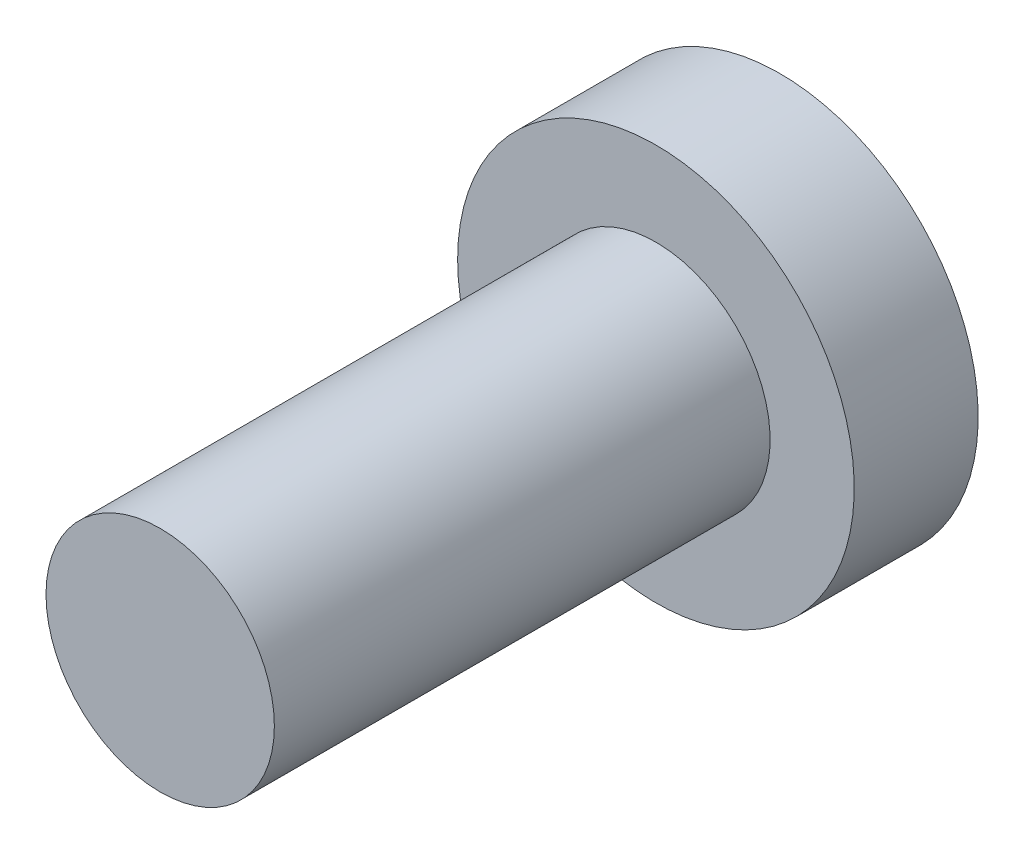
ISO-10303-21;
HEADER;
FILE_DESCRIPTION(('STEP AP214'),'2;1');
FILE_NAME('part.step','',(''),(''),'','','');
FILE_SCHEMA(('AUTOMOTIVE_DESIGN { 1 0 10303 214 1 1 1 1 }'));
ENDSEC;
DATA;
#1=APPLICATION_CONTEXT('core data for automotive mechanical design processes');
#2=APPLICATION_PROTOCOL_DEFINITION('international standard','automotive_design',2000,#1);
#3=PRODUCT_CONTEXT('',#1,'mechanical');
#4=PRODUCT('Part','Part','',(#3));
#5=PRODUCT_RELATED_PRODUCT_CATEGORY('part','',(#4));
#6=PRODUCT_DEFINITION_FORMATION('','',#4);
#7=PRODUCT_DEFINITION_CONTEXT('part definition',#1,'design');
#8=PRODUCT_DEFINITION('design','',#6,#7);
#9=PRODUCT_DEFINITION_SHAPE('','',#8);
#10=(LENGTH_UNIT() NAMED_UNIT(*) SI_UNIT(.MILLI.,.METRE.));
#11=(NAMED_UNIT(*) PLANE_ANGLE_UNIT() SI_UNIT($,.RADIAN.));
#12=(NAMED_UNIT(*) SI_UNIT($,.STERADIAN.) SOLID_ANGLE_UNIT());
#13=UNCERTAINTY_MEASURE_WITH_UNIT(LENGTH_MEASURE(1.E-05),#10,'distance_accuracy_value','');
#14=(GEOMETRIC_REPRESENTATION_CONTEXT(3) GLOBAL_UNCERTAINTY_ASSIGNED_CONTEXT((#13)) GLOBAL_UNIT_ASSIGNED_CONTEXT((#10,
#11,#12)) REPRESENTATION_CONTEXT('',''));
#15=CARTESIAN_POINT('',(0.,0.,0.));
#16=DIRECTION('',(0.,0.,1.));
#17=DIRECTION('',(1.,0.,0.));
#18=AXIS2_PLACEMENT_3D('',#15,#16,#17);
#19=CARTESIAN_POINT('',(0.,0.,12.7));
#20=DIRECTION('',(0.,0.,-1.));
#21=DIRECTION('',(-1.,0.,0.));
#22=AXIS2_PLACEMENT_3D('',#19,#20,#21);
#23=CYLINDRICAL_SURFACE('',#22,2.924999992);
#24=CARTESIAN_POINT('',(0.,0.,12.7));
#25=DIRECTION('',(0.,0.,1.));
#26=DIRECTION('',(1.,0.,0.));
#27=AXIS2_PLACEMENT_3D('',#24,#25,#26);
#28=CIRCLE('',#27,2.924999992);
#29=CARTESIAN_POINT('',(2.924999992,0.,12.7));
#30=VERTEX_POINT('',#29);
#31=EDGE_CURVE('E11',#30,#30,#28,.T.);
#32=ORIENTED_EDGE('',*,*,#31,.F.);
#33=EDGE_LOOP('',(#32));
#34=FACE_BOUND('',#33,.T.);
#35=CARTESIAN_POINT('',(0.,0.,0.));
#36=DIRECTION('',(0.,0.,-1.));
#37=DIRECTION('',(-1.,0.,0.));
#38=AXIS2_PLACEMENT_3D('',#35,#36,#37);
#39=CIRCLE('',#38,2.924999992);
#40=CARTESIAN_POINT('',(-2.924999992,0.,0.));
#41=VERTEX_POINT('',#40);
#42=EDGE_CURVE('E42',#41,#41,#39,.F.);
#43=ORIENTED_EDGE('',*,*,#42,.T.);
#44=EDGE_LOOP('',(#43));
#45=FACE_BOUND('',#44,.T.);
#46=ADVANCED_FACE('F39',(#34,#45),#23,.T.);
#47=CARTESIAN_POINT('',(0.,0.,12.7));
#48=DIRECTION('',(0.,0.,1.));
#49=DIRECTION('',(1.,0.,0.));
#50=AXIS2_PLACEMENT_3D('',#47,#48,#49);
#51=PLANE('',#50);
#52=ORIENTED_EDGE('',*,*,#31,.T.);
#53=EDGE_LOOP('',(#52));
#54=FACE_BOUND('',#53,.T.);
#55=ADVANCED_FACE('F66',(#54),#51,.T.);
#56=CARTESIAN_POINT('',(0.,0.,-3.175));
#57=DIRECTION('',(0.,0.,1.));
#58=DIRECTION('',(1.,0.,0.));
#59=AXIS2_PLACEMENT_3D('',#56,#57,#58);
#60=CYLINDRICAL_SURFACE('',#59,5.08);
#61=CARTESIAN_POINT('',(0.,0.,-3.175));
#62=DIRECTION('',(0.,0.,-1.));
#63=DIRECTION('',(-1.,0.,0.));
#64=AXIS2_PLACEMENT_3D('',#61,#62,#63);
#65=CIRCLE('',#64,5.08);
#66=CARTESIAN_POINT('',(-5.08,0.,-3.175));
#67=VERTEX_POINT('',#66);
#68=EDGE_CURVE('E51',#67,#67,#65,.T.);
#69=ORIENTED_EDGE('',*,*,#68,.F.);
#70=EDGE_LOOP('',(#69));
#71=FACE_BOUND('',#70,.T.);
#72=CARTESIAN_POINT('',(0.,0.,0.));
#73=DIRECTION('',(0.,0.,-1.));
#74=DIRECTION('',(-1.,0.,0.));
#75=AXIS2_PLACEMENT_3D('',#72,#73,#74);
#76=CIRCLE('',#75,5.08);
#77=CARTESIAN_POINT('',(-5.08,0.,0.));
#78=VERTEX_POINT('',#77);
#79=EDGE_CURVE('E53',#78,#78,#76,.T.);
#80=ORIENTED_EDGE('',*,*,#79,.T.);
#81=EDGE_LOOP('',(#80));
#82=FACE_BOUND('',#81,.T.);
#83=ADVANCED_FACE('F63',(#71,#82),#60,.T.);
#84=CARTESIAN_POINT('',(0.,0.,-3.175));
#85=DIRECTION('',(0.,0.,-1.));
#86=DIRECTION('',(-1.,0.,0.));
#87=AXIS2_PLACEMENT_3D('',#84,#85,#86);
#88=PLANE('',#87);
#89=ORIENTED_EDGE('',*,*,#68,.T.);
#90=EDGE_LOOP('',(#89));
#91=FACE_BOUND('',#90,.T.);
#92=ADVANCED_FACE('F61',(#91),#88,.T.);
#93=CARTESIAN_POINT('',(0.,0.,0.));
#94=DIRECTION('',(0.,0.,-1.));
#95=DIRECTION('',(-1.,0.,0.));
#96=AXIS2_PLACEMENT_3D('',#93,#94,#95);
#97=PLANE('',#96);
#98=ORIENTED_EDGE('',*,*,#42,.F.);
#99=EDGE_LOOP('',(#98));
#100=FACE_BOUND('',#99,.T.);
#101=ORIENTED_EDGE('',*,*,#79,.F.);
#102=EDGE_LOOP('',(#101));
#103=FACE_BOUND('',#102,.T.);
#104=ADVANCED_FACE('F70',(#100,#103),#97,.F.);
#105=CLOSED_SHELL('',(#46,#55,#83,#92,#104));
#106=MANIFOLD_SOLID_BREP('B2',#105);
#107=ADVANCED_BREP_SHAPE_REPRESENTATION('',(#18,#106),#14);
#108=SHAPE_DEFINITION_REPRESENTATION(#9,#107);
ENDSEC;
END-ISO-10303-21;
